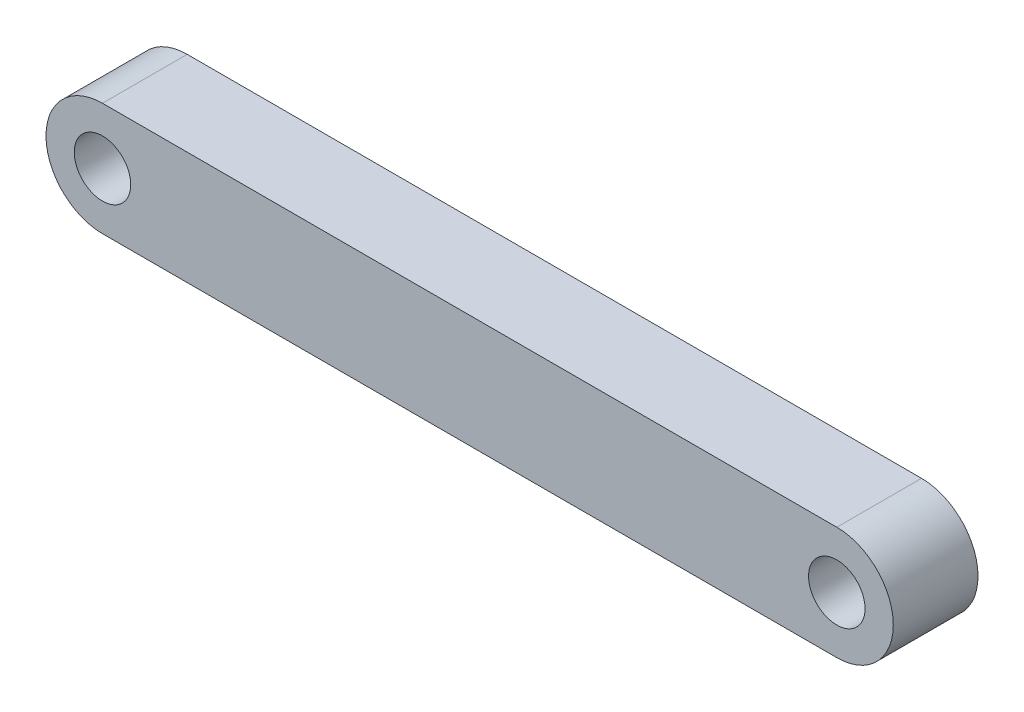
ISO-10303-21;
HEADER;
FILE_DESCRIPTION(('STEP AP214'),'2;1');
FILE_NAME('part.step','',(''),(''),'','','');
FILE_SCHEMA(('AUTOMOTIVE_DESIGN { 1 0 10303 214 1 1 1 1 }'));
ENDSEC;
DATA;
#1=APPLICATION_CONTEXT('core data for automotive mechanical design processes');
#2=APPLICATION_PROTOCOL_DEFINITION('international standard','automotive_design',2000,#1);
#3=PRODUCT_CONTEXT('',#1,'mechanical');
#4=PRODUCT('Part','Part','',(#3));
#5=PRODUCT_RELATED_PRODUCT_CATEGORY('part','',(#4));
#6=PRODUCT_DEFINITION_FORMATION('','',#4);
#7=PRODUCT_DEFINITION_CONTEXT('part definition',#1,'design');
#8=PRODUCT_DEFINITION('design','',#6,#7);
#9=PRODUCT_DEFINITION_SHAPE('','',#8);
#10=(LENGTH_UNIT() NAMED_UNIT(*) SI_UNIT(.MILLI.,.METRE.));
#11=(NAMED_UNIT(*) PLANE_ANGLE_UNIT() SI_UNIT($,.RADIAN.));
#12=(NAMED_UNIT(*) SI_UNIT($,.STERADIAN.) SOLID_ANGLE_UNIT());
#13=UNCERTAINTY_MEASURE_WITH_UNIT(LENGTH_MEASURE(1.E-05),#10,'distance_accuracy_value','');
#14=(GEOMETRIC_REPRESENTATION_CONTEXT(3) GLOBAL_UNCERTAINTY_ASSIGNED_CONTEXT((#13)) GLOBAL_UNIT_ASSIGNED_CONTEXT((#10,
#11,#12)) REPRESENTATION_CONTEXT('',''));
#15=CARTESIAN_POINT('',(0.,0.,0.));
#16=DIRECTION('',(0.,0.,1.));
#17=DIRECTION('',(1.,0.,0.));
#18=AXIS2_PLACEMENT_3D('',#15,#16,#17);
#19=CARTESIAN_POINT('',(130.,0.,30.));
#20=DIRECTION('',(0.,0.,-1.));
#21=DIRECTION('',(-1.,0.,0.));
#22=AXIS2_PLACEMENT_3D('',#19,#20,#21);
#23=CYLINDRICAL_SURFACE('',#22,20.);
#24=DIRECTION('',(0.,0.,-1.));
#25=VECTOR('',#24,1.);
#26=CARTESIAN_POINT('',(130.,20.,30.));
#27=LINE('',#26,#25);
#28=CARTESIAN_POINT('',(130.,20.,30.));
#29=VERTEX_POINT('',#28);
#30=CARTESIAN_POINT('',(130.,20.,0.));
#31=VERTEX_POINT('',#30);
#32=EDGE_CURVE('E87',#29,#31,#27,.T.);
#33=ORIENTED_EDGE('',*,*,#32,.F.);
#34=CARTESIAN_POINT('',(130.,0.,30.));
#35=DIRECTION('',(0.,0.,1.));
#36=DIRECTION('',(1.,0.,0.));
#37=AXIS2_PLACEMENT_3D('',#34,#35,#36);
#38=CIRCLE('',#37,20.);
#39=CARTESIAN_POINT('',(130.,-20.,30.));
#40=VERTEX_POINT('',#39);
#41=EDGE_CURVE('E50',#40,#29,#38,.T.);
#42=ORIENTED_EDGE('',*,*,#41,.F.);
#43=DIRECTION('',(0.,0.,-1.));
#44=VECTOR('',#43,1.);
#45=CARTESIAN_POINT('',(130.,-20.,30.));
#46=LINE('',#45,#44);
#47=CARTESIAN_POINT('',(130.,-20.,0.));
#48=VERTEX_POINT('',#47);
#49=EDGE_CURVE('E119',#48,#40,#46,.F.);
#50=ORIENTED_EDGE('',*,*,#49,.F.);
#51=CARTESIAN_POINT('',(130.,0.,0.));
#52=DIRECTION('',(0.,0.,1.));
#53=DIRECTION('',(1.,0.,0.));
#54=AXIS2_PLACEMENT_3D('',#51,#52,#53);
#55=CIRCLE('',#54,20.);
#56=EDGE_CURVE('E11',#31,#48,#55,.F.);
#57=ORIENTED_EDGE('',*,*,#56,.F.);
#58=EDGE_LOOP('',(#33,#42,#50,#57));
#59=FACE_BOUND('',#58,.T.);
#60=ADVANCED_FACE('F41',(#59),#23,.T.);
#61=CARTESIAN_POINT('',(-130.,0.,0.));
#62=DIRECTION('',(0.,0.,-1.));
#63=DIRECTION('',(-1.,0.,0.));
#64=AXIS2_PLACEMENT_3D('',#61,#62,#63);
#65=CYLINDRICAL_SURFACE('',#64,20.);
#66=DIRECTION('',(0.,0.,-1.));
#67=VECTOR('',#66,1.);
#68=CARTESIAN_POINT('',(-130.,20.,30.));
#69=LINE('',#68,#67);
#70=CARTESIAN_POINT('',(-130.,20.,0.));
#71=VERTEX_POINT('',#70);
#72=CARTESIAN_POINT('',(-130.,20.,30.));
#73=VERTEX_POINT('',#72);
#74=EDGE_CURVE('E86',#71,#73,#69,.F.);
#75=ORIENTED_EDGE('',*,*,#74,.F.);
#76=CARTESIAN_POINT('',(-130.,0.,0.));
#77=DIRECTION('',(0.,0.,1.));
#78=DIRECTION('',(1.,0.,0.));
#79=AXIS2_PLACEMENT_3D('',#76,#77,#78);
#80=CIRCLE('',#79,20.);
#81=CARTESIAN_POINT('',(-130.,-20.,0.));
#82=VERTEX_POINT('',#81);
#83=EDGE_CURVE('E92',#82,#71,#80,.F.);
#84=ORIENTED_EDGE('',*,*,#83,.F.);
#85=DIRECTION('',(0.,0.,-1.));
#86=VECTOR('',#85,1.);
#87=CARTESIAN_POINT('',(-130.,-20.,30.));
#88=LINE('',#87,#86);
#89=CARTESIAN_POINT('',(-130.,-20.,30.));
#90=VERTEX_POINT('',#89);
#91=EDGE_CURVE('E100',#90,#82,#88,.T.);
#92=ORIENTED_EDGE('',*,*,#91,.F.);
#93=CARTESIAN_POINT('',(-130.,0.,30.));
#94=DIRECTION('',(0.,0.,1.));
#95=DIRECTION('',(1.,0.,0.));
#96=AXIS2_PLACEMENT_3D('',#93,#94,#95);
#97=CIRCLE('',#96,20.);
#98=EDGE_CURVE('E99',#73,#90,#97,.T.);
#99=ORIENTED_EDGE('',*,*,#98,.F.);
#100=EDGE_LOOP('',(#75,#84,#92,#99));
#101=FACE_BOUND('',#100,.T.);
#102=ADVANCED_FACE('F103',(#101),#65,.T.);
#103=CARTESIAN_POINT('',(-150.,20.,30.));
#104=DIRECTION('',(0.,-1.,0.));
#105=DIRECTION('',(0.,0.,-1.));
#106=AXIS2_PLACEMENT_3D('',#103,#104,#105);
#107=PLANE('',#106);
#108=DIRECTION('',(-1.,0.,0.));
#109=VECTOR('',#108,1.);
#110=CARTESIAN_POINT('',(-150.,20.,30.));
#111=LINE('',#110,#109);
#112=EDGE_CURVE('E111',#29,#73,#111,.T.);
#113=ORIENTED_EDGE('',*,*,#112,.F.);
#114=ORIENTED_EDGE('',*,*,#32,.T.);
#115=DIRECTION('',(-1.,0.,0.));
#116=VECTOR('',#115,1.);
#117=CARTESIAN_POINT('',(-150.,20.,0.));
#118=LINE('',#117,#116);
#119=EDGE_CURVE('E81',#31,#71,#118,.T.);
#120=ORIENTED_EDGE('',*,*,#119,.T.);
#121=ORIENTED_EDGE('',*,*,#74,.T.);
#122=EDGE_LOOP('',(#113,#114,#120,#121));
#123=FACE_BOUND('',#122,.T.);
#124=ADVANCED_FACE('F84',(#123),#107,.F.);
#125=CARTESIAN_POINT('',(-150.,-20.,30.));
#126=DIRECTION('',(0.,1.,0.));
#127=DIRECTION('',(0.,0.,1.));
#128=AXIS2_PLACEMENT_3D('',#125,#126,#127);
#129=PLANE('',#128);
#130=DIRECTION('',(1.,0.,0.));
#131=VECTOR('',#130,1.);
#132=CARTESIAN_POINT('',(-150.,-20.,0.));
#133=LINE('',#132,#131);
#134=EDGE_CURVE('E89',#82,#48,#133,.T.);
#135=ORIENTED_EDGE('',*,*,#134,.T.);
#136=ORIENTED_EDGE('',*,*,#49,.T.);
#137=DIRECTION('',(1.,0.,0.));
#138=VECTOR('',#137,1.);
#139=CARTESIAN_POINT('',(-150.,-20.,30.));
#140=LINE('',#139,#138);
#141=EDGE_CURVE('E105',#90,#40,#140,.T.);
#142=ORIENTED_EDGE('',*,*,#141,.F.);
#143=ORIENTED_EDGE('',*,*,#91,.T.);
#144=EDGE_LOOP('',(#135,#136,#142,#143));
#145=FACE_BOUND('',#144,.T.);
#146=ADVANCED_FACE('F156',(#145),#129,.F.);
#147=CARTESIAN_POINT('',(0.,0.,30.));
#148=DIRECTION('',(0.,0.,1.));
#149=DIRECTION('',(1.,0.,0.));
#150=AXIS2_PLACEMENT_3D('',#147,#148,#149);
#151=PLANE('',#150);
#152=CARTESIAN_POINT('',(-130.,0.,30.));
#153=DIRECTION('',(0.,0.,1.));
#154=DIRECTION('',(1.,0.,0.));
#155=AXIS2_PLACEMENT_3D('',#152,#153,#154);
#156=CIRCLE('',#155,9.99999999999998);
#157=CARTESIAN_POINT('',(-120.,0.,30.));
#158=VERTEX_POINT('',#157);
#159=EDGE_CURVE('E137',#158,#158,#156,.T.);
#160=ORIENTED_EDGE('',*,*,#159,.F.);
#161=EDGE_LOOP('',(#160));
#162=FACE_BOUND('',#161,.T.);
#163=CARTESIAN_POINT('',(130.,0.,30.));
#164=DIRECTION('',(0.,0.,1.));
#165=DIRECTION('',(1.,0.,0.));
#166=AXIS2_PLACEMENT_3D('',#163,#164,#165);
#167=CIRCLE('',#166,10.);
#168=CARTESIAN_POINT('',(140.,0.,30.));
#169=VERTEX_POINT('',#168);
#170=EDGE_CURVE('E129',#169,#169,#167,.T.);
#171=ORIENTED_EDGE('',*,*,#170,.F.);
#172=EDGE_LOOP('',(#171));
#173=FACE_BOUND('',#172,.T.);
#174=ORIENTED_EDGE('',*,*,#141,.T.);
#175=ORIENTED_EDGE('',*,*,#41,.T.);
#176=ORIENTED_EDGE('',*,*,#112,.T.);
#177=ORIENTED_EDGE('',*,*,#98,.T.);
#178=EDGE_LOOP('',(#174,#175,#176,#177));
#179=FACE_BOUND('',#178,.T.);
#180=ADVANCED_FACE('F123',(#162,#173,#179),#151,.T.);
#181=CARTESIAN_POINT('',(0.,0.,0.));
#182=DIRECTION('',(0.,0.,1.));
#183=DIRECTION('',(1.,0.,0.));
#184=AXIS2_PLACEMENT_3D('',#181,#182,#183);
#185=PLANE('',#184);
#186=CARTESIAN_POINT('',(-130.,0.,0.));
#187=DIRECTION('',(0.,0.,1.));
#188=DIRECTION('',(1.,0.,0.));
#189=AXIS2_PLACEMENT_3D('',#186,#187,#188);
#190=CIRCLE('',#189,9.99999999999998);
#191=CARTESIAN_POINT('',(-120.,0.,0.));
#192=VERTEX_POINT('',#191);
#193=EDGE_CURVE('E90',#192,#192,#190,.T.);
#194=ORIENTED_EDGE('',*,*,#193,.T.);
#195=EDGE_LOOP('',(#194));
#196=FACE_BOUND('',#195,.T.);
#197=CARTESIAN_POINT('',(130.,0.,0.));
#198=DIRECTION('',(0.,0.,1.));
#199=DIRECTION('',(1.,0.,0.));
#200=AXIS2_PLACEMENT_3D('',#197,#198,#199);
#201=CIRCLE('',#200,10.);
#202=CARTESIAN_POINT('',(140.,0.,0.));
#203=VERTEX_POINT('',#202);
#204=EDGE_CURVE('E133',#203,#203,#201,.T.);
#205=ORIENTED_EDGE('',*,*,#204,.T.);
#206=EDGE_LOOP('',(#205));
#207=FACE_BOUND('',#206,.T.);
#208=ORIENTED_EDGE('',*,*,#119,.F.);
#209=ORIENTED_EDGE('',*,*,#56,.T.);
#210=ORIENTED_EDGE('',*,*,#134,.F.);
#211=ORIENTED_EDGE('',*,*,#83,.T.);
#212=EDGE_LOOP('',(#208,#209,#210,#211));
#213=FACE_BOUND('',#212,.T.);
#214=ADVANCED_FACE('F93',(#196,#207,#213),#185,.F.);
#215=CARTESIAN_POINT('',(130.,0.,0.));
#216=DIRECTION('',(0.,0.,1.));
#217=DIRECTION('',(1.,0.,0.));
#218=AXIS2_PLACEMENT_3D('',#215,#216,#217);
#219=CYLINDRICAL_SURFACE('',#218,10.);
#220=ORIENTED_EDGE('',*,*,#204,.F.);
#221=EDGE_LOOP('',(#220));
#222=FACE_BOUND('',#221,.T.);
#223=ORIENTED_EDGE('',*,*,#170,.T.);
#224=EDGE_LOOP('',(#223));
#225=FACE_BOUND('',#224,.T.);
#226=ADVANCED_FACE('F150',(#222,#225),#219,.F.);
#227=CARTESIAN_POINT('',(-130.,0.,0.));
#228=DIRECTION('',(0.,0.,1.));
#229=DIRECTION('',(1.,0.,0.));
#230=AXIS2_PLACEMENT_3D('',#227,#228,#229);
#231=CYLINDRICAL_SURFACE('',#230,9.99999999999998);
#232=ORIENTED_EDGE('',*,*,#193,.F.);
#233=EDGE_LOOP('',(#232));
#234=FACE_BOUND('',#233,.T.);
#235=ORIENTED_EDGE('',*,*,#159,.T.);
#236=EDGE_LOOP('',(#235));
#237=FACE_BOUND('',#236,.T.);
#238=ADVANCED_FACE('F147',(#234,#237),#231,.F.);
#239=CLOSED_SHELL('',(#60,#102,#124,#146,#180,#214,#226,#238));
#240=MANIFOLD_SOLID_BREP('B2',#239);
#241=ADVANCED_BREP_SHAPE_REPRESENTATION('',(#18,#240),#14);
#242=SHAPE_DEFINITION_REPRESENTATION(#9,#241);
ENDSEC;
END-ISO-10303-21;
